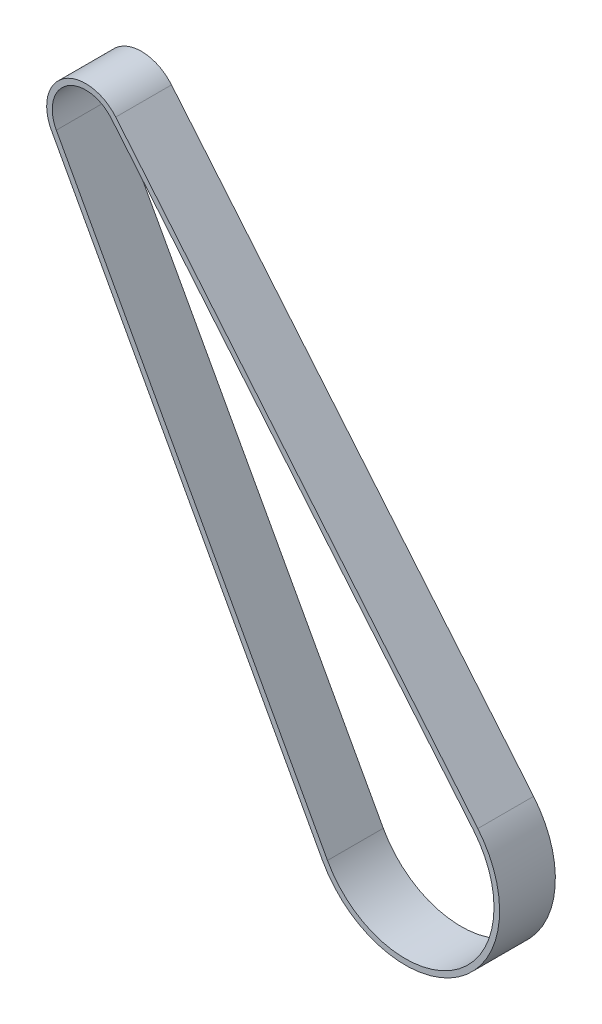
ISO-10303-21;
HEADER;
FILE_DESCRIPTION(('STEP AP214'),'2;1');
FILE_NAME('part.step','',(''),(''),'','','');
FILE_SCHEMA(('AUTOMOTIVE_DESIGN { 1 0 10303 214 1 1 1 1 }'));
ENDSEC;
DATA;
#1=APPLICATION_CONTEXT('core data for automotive mechanical design processes');
#2=APPLICATION_PROTOCOL_DEFINITION('international standard','automotive_design',2000,#1);
#3=PRODUCT_CONTEXT('',#1,'mechanical');
#4=PRODUCT('Part','Part','',(#3));
#5=PRODUCT_RELATED_PRODUCT_CATEGORY('part','',(#4));
#6=PRODUCT_DEFINITION_FORMATION('','',#4);
#7=PRODUCT_DEFINITION_CONTEXT('part definition',#1,'design');
#8=PRODUCT_DEFINITION('design','',#6,#7);
#9=PRODUCT_DEFINITION_SHAPE('','',#8);
#10=(LENGTH_UNIT() NAMED_UNIT(*) SI_UNIT(.MILLI.,.METRE.));
#11=(NAMED_UNIT(*) PLANE_ANGLE_UNIT() SI_UNIT($,.RADIAN.));
#12=(NAMED_UNIT(*) SI_UNIT($,.STERADIAN.) SOLID_ANGLE_UNIT());
#13=UNCERTAINTY_MEASURE_WITH_UNIT(LENGTH_MEASURE(1.E-05),#10,'distance_accuracy_value','');
#14=(GEOMETRIC_REPRESENTATION_CONTEXT(3) GLOBAL_UNCERTAINTY_ASSIGNED_CONTEXT((#13)) GLOBAL_UNIT_ASSIGNED_CONTEXT((#10,
#11,#12)) REPRESENTATION_CONTEXT('',''));
#15=CARTESIAN_POINT('',(0.,0.,0.));
#16=DIRECTION('',(0.,0.,1.));
#17=DIRECTION('',(1.,0.,0.));
#18=AXIS2_PLACEMENT_3D('',#15,#16,#17);
#19=CARTESIAN_POINT('',(0.,0.,10.));
#20=DIRECTION('',(0.,0.,1.));
#21=DIRECTION('',(1.,0.,0.));
#22=AXIS2_PLACEMENT_3D('',#19,#20,#21);
#23=PLANE('',#22);
#24=CARTESIAN_POINT('',(0.,0.,10.));
#25=DIRECTION('',(0.,0.,1.));
#26=DIRECTION('',(-1.,0.,0.));
#27=AXIS2_PLACEMENT_3D('',#24,#25,#26);
#28=CIRCLE('',#27,7.);
#29=CARTESIAN_POINT('',(5.38077329287627,4.47741876204018,10.));
#30=VERTEX_POINT('',#29);
#31=CARTESIAN_POINT('',(-6.14458476051221,-3.3532190684298,10.));
#32=VERTEX_POINT('',#31);
#33=EDGE_CURVE('E160',#30,#32,#28,.T.);
#34=ORIENTED_EDGE('',*,*,#33,.T.);
#35=DIRECTION('',(0.479031295489971,-0.877797822930315,0.));
#36=VECTOR('',#35,1.);
#37=CARTESIAN_POINT('',(42.4748656660749,-92.4456189561528,10.));
#38=LINE('',#37,#36);
#39=CARTESIAN_POINT('',(42.4748656660749,-92.4456189561528,10.));
#40=VERTEX_POINT('',#39);
#41=EDGE_CURVE('E163',#32,#40,#38,.T.);
#42=ORIENTED_EDGE('',*,*,#41,.T.);
#43=CARTESIAN_POINT('',(57.3096488735972,-84.3499900623723,10.));
#44=DIRECTION('',(0.,0.,1.));
#45=DIRECTION('',(-1.,0.,0.));
#46=AXIS2_PLACEMENT_3D('',#43,#44,#45);
#47=CIRCLE('',#46,16.9);
#48=CARTESIAN_POINT('',(70.3003729663985,-73.5402219083039,10.));
#49=VERTEX_POINT('',#48);
#50=EDGE_CURVE('E166',#40,#49,#47,.T.);
#51=ORIENTED_EDGE('',*,*,#50,.T.);
#52=DIRECTION('',(-0.639631251720026,0.768681898982325,0.));
#53=VECTOR('',#52,1.);
#54=CARTESIAN_POINT('',(5.38077329287627,4.47741876204018,10.));
#55=LINE('',#54,#53);
#56=EDGE_CURVE('E168',#49,#30,#55,.T.);
#57=ORIENTED_EDGE('',*,*,#56,.T.);
#58=EDGE_LOOP('',(#34,#42,#51,#57));
#59=FACE_BOUND('',#58,.T.);
#60=DIRECTION('',(0.479031295489971,-0.877797822930315,0.));
#61=VECTOR('',#60,1.);
#62=CARTESIAN_POINT('',(-5.26678693758189,-2.87418777293983,10.));
#63=LINE('',#62,#61);
#64=CARTESIAN_POINT('',(-5.26678693758189,-2.87418777293982,10.));
#65=VERTEX_POINT('',#64);
#66=CARTESIAN_POINT('',(43.3526634890052,-91.9665876606629,10.));
#67=VERTEX_POINT('',#66);
#68=EDGE_CURVE('E132',#65,#67,#63,.T.);
#69=ORIENTED_EDGE('',*,*,#68,.F.);
#70=CARTESIAN_POINT('',(0.,0.,10.));
#71=DIRECTION('',(0.,0.,-1.));
#72=DIRECTION('',(-1.,0.,0.));
#73=AXIS2_PLACEMENT_3D('',#70,#71,#72);
#74=CIRCLE('',#73,6.);
#75=CARTESIAN_POINT('',(4.61209139389395,3.83778751032016,10.));
#76=VERTEX_POINT('',#75);
#77=EDGE_CURVE('E124',#76,#65,#74,.F.);
#78=ORIENTED_EDGE('',*,*,#77,.F.);
#79=DIRECTION('',(-0.639631251720026,0.768681898982325,0.));
#80=VECTOR('',#79,1.);
#81=CARTESIAN_POINT('',(4.61209139389395,3.83778751032016,10.));
#82=LINE('',#81,#80);
#83=CARTESIAN_POINT('',(69.5316910674162,-74.1798531600239,10.));
#84=VERTEX_POINT('',#83);
#85=EDGE_CURVE('E146',#84,#76,#82,.T.);
#86=ORIENTED_EDGE('',*,*,#85,.F.);
#87=CARTESIAN_POINT('',(57.3096488735972,-84.3499900623723,10.));
#88=DIRECTION('',(0.,0.,-1.));
#89=DIRECTION('',(-1.,0.,0.));
#90=AXIS2_PLACEMENT_3D('',#87,#88,#89);
#91=CIRCLE('',#90,15.9);
#92=EDGE_CURVE('E144',#67,#84,#91,.F.);
#93=ORIENTED_EDGE('',*,*,#92,.F.);
#94=EDGE_LOOP('',(#69,#78,#86,#93));
#95=FACE_BOUND('',#94,.T.);
#96=ADVANCED_FACE('F59',(#59,#95),#23,.T.);
#97=CARTESIAN_POINT('',(0.,0.,0.));
#98=DIRECTION('',(0.,0.,1.));
#99=DIRECTION('',(1.,0.,0.));
#100=AXIS2_PLACEMENT_3D('',#97,#98,#99);
#101=PLANE('',#100);
#102=CARTESIAN_POINT('',(0.,0.,0.));
#103=DIRECTION('',(0.,0.,1.));
#104=DIRECTION('',(-1.,0.,0.));
#105=AXIS2_PLACEMENT_3D('',#102,#103,#104);
#106=CIRCLE('',#105,7.);
#107=CARTESIAN_POINT('',(5.38077329287627,4.47741876204018,0.));
#108=VERTEX_POINT('',#107);
#109=CARTESIAN_POINT('',(-6.14458476051221,-3.3532190684298,0.));
#110=VERTEX_POINT('',#109);
#111=EDGE_CURVE('E140',#108,#110,#106,.T.);
#112=ORIENTED_EDGE('',*,*,#111,.F.);
#113=DIRECTION('',(-0.639631251720026,0.768681898982325,0.));
#114=VECTOR('',#113,1.);
#115=CARTESIAN_POINT('',(5.38077329287627,4.47741876204018,0.));
#116=LINE('',#115,#114);
#117=CARTESIAN_POINT('',(70.3003729663985,-73.5402219083039,0.));
#118=VERTEX_POINT('',#117);
#119=EDGE_CURVE('E164',#118,#108,#116,.T.);
#120=ORIENTED_EDGE('',*,*,#119,.F.);
#121=CARTESIAN_POINT('',(57.3096488735972,-84.3499900623723,0.));
#122=DIRECTION('',(0.,0.,1.));
#123=DIRECTION('',(-1.,0.,0.));
#124=AXIS2_PLACEMENT_3D('',#121,#122,#123);
#125=CIRCLE('',#124,16.9);
#126=CARTESIAN_POINT('',(42.4748656660749,-92.4456189561528,0.));
#127=VERTEX_POINT('',#126);
#128=EDGE_CURVE('E175',#127,#118,#125,.T.);
#129=ORIENTED_EDGE('',*,*,#128,.F.);
#130=DIRECTION('',(0.479031295489971,-0.877797822930315,0.));
#131=VECTOR('',#130,1.);
#132=CARTESIAN_POINT('',(42.4748656660749,-92.4456189561528,0.));
#133=LINE('',#132,#131);
#134=EDGE_CURVE('E173',#110,#127,#133,.T.);
#135=ORIENTED_EDGE('',*,*,#134,.F.);
#136=EDGE_LOOP('',(#112,#120,#129,#135));
#137=FACE_BOUND('',#136,.T.);
#138=CARTESIAN_POINT('',(0.,0.,0.));
#139=DIRECTION('',(0.,0.,-1.));
#140=DIRECTION('',(-1.,0.,0.));
#141=AXIS2_PLACEMENT_3D('',#138,#139,#140);
#142=CIRCLE('',#141,6.);
#143=CARTESIAN_POINT('',(4.61209139389395,3.83778751032016,0.));
#144=VERTEX_POINT('',#143);
#145=CARTESIAN_POINT('',(-5.26678693758189,-2.87418777293982,0.));
#146=VERTEX_POINT('',#145);
#147=EDGE_CURVE('E82',#144,#146,#142,.F.);
#148=ORIENTED_EDGE('',*,*,#147,.T.);
#149=DIRECTION('',(0.479031295489971,-0.877797822930315,0.));
#150=VECTOR('',#149,1.);
#151=CARTESIAN_POINT('',(-5.26678693758189,-2.87418777293983,0.));
#152=LINE('',#151,#150);
#153=CARTESIAN_POINT('',(43.3526634890052,-91.9665876606629,0.));
#154=VERTEX_POINT('',#153);
#155=EDGE_CURVE('E139',#146,#154,#152,.T.);
#156=ORIENTED_EDGE('',*,*,#155,.T.);
#157=CARTESIAN_POINT('',(57.3096488735972,-84.3499900623723,0.));
#158=DIRECTION('',(0.,0.,-1.));
#159=DIRECTION('',(-1.,0.,0.));
#160=AXIS2_PLACEMENT_3D('',#157,#158,#159);
#161=CIRCLE('',#160,15.9);
#162=CARTESIAN_POINT('',(69.5316910674162,-74.1798531600239,0.));
#163=VERTEX_POINT('',#162);
#164=EDGE_CURVE('E152',#154,#163,#161,.F.);
#165=ORIENTED_EDGE('',*,*,#164,.T.);
#166=DIRECTION('',(-0.639631251720026,0.768681898982325,0.));
#167=VECTOR('',#166,1.);
#168=CARTESIAN_POINT('',(4.61209139389395,3.83778751032016,0.));
#169=LINE('',#168,#167);
#170=EDGE_CURVE('E133',#163,#144,#169,.T.);
#171=ORIENTED_EDGE('',*,*,#170,.T.);
#172=EDGE_LOOP('',(#148,#156,#165,#171));
#173=FACE_BOUND('',#172,.T.);
#174=ADVANCED_FACE('F193',(#137,#173),#101,.F.);
#175=CARTESIAN_POINT('',(0.,0.,10.));
#176=DIRECTION('',(0.,0.,-1.));
#177=DIRECTION('',(-1.,0.,0.));
#178=AXIS2_PLACEMENT_3D('',#175,#176,#177);
#179=CYLINDRICAL_SURFACE('',#178,7.);
#180=ORIENTED_EDGE('',*,*,#111,.T.);
#181=DIRECTION('',(0.,0.,-1.));
#182=VECTOR('',#181,1.);
#183=CARTESIAN_POINT('',(-6.14458476051221,-3.3532190684298,10.));
#184=LINE('',#183,#182);
#185=EDGE_CURVE('E12',#32,#110,#184,.T.);
#186=ORIENTED_EDGE('',*,*,#185,.F.);
#187=ORIENTED_EDGE('',*,*,#33,.F.);
#188=DIRECTION('',(0.,0.,-1.));
#189=VECTOR('',#188,1.);
#190=CARTESIAN_POINT('',(5.38077329287627,4.47741876204018,10.));
#191=LINE('',#190,#189);
#192=EDGE_CURVE('E170',#30,#108,#191,.T.);
#193=ORIENTED_EDGE('',*,*,#192,.T.);
#194=EDGE_LOOP('',(#180,#186,#187,#193));
#195=FACE_BOUND('',#194,.T.);
#196=ADVANCED_FACE('F61',(#195),#179,.T.);
#197=CARTESIAN_POINT('',(42.4748656660749,-92.4456189561528,10.));
#198=DIRECTION('',(0.877797822930315,0.479031295489971,0.));
#199=DIRECTION('',(-0.479031295489971,0.877797822930315,0.));
#200=AXIS2_PLACEMENT_3D('',#197,#198,#199);
#201=PLANE('',#200);
#202=ORIENTED_EDGE('',*,*,#134,.T.);
#203=DIRECTION('',(0.,0.,-1.));
#204=VECTOR('',#203,1.);
#205=CARTESIAN_POINT('',(42.4748656660749,-92.4456189561528,10.));
#206=LINE('',#205,#204);
#207=EDGE_CURVE('E67',#40,#127,#206,.T.);
#208=ORIENTED_EDGE('',*,*,#207,.F.);
#209=ORIENTED_EDGE('',*,*,#41,.F.);
#210=ORIENTED_EDGE('',*,*,#185,.T.);
#211=EDGE_LOOP('',(#202,#208,#209,#210));
#212=FACE_BOUND('',#211,.T.);
#213=ADVANCED_FACE('F203',(#212),#201,.F.);
#214=CARTESIAN_POINT('',(57.3096488735972,-84.3499900623723,10.));
#215=DIRECTION('',(0.,0.,-1.));
#216=DIRECTION('',(-1.,0.,0.));
#217=AXIS2_PLACEMENT_3D('',#214,#215,#216);
#218=CYLINDRICAL_SURFACE('',#217,16.9);
#219=ORIENTED_EDGE('',*,*,#128,.T.);
#220=DIRECTION('',(0.,0.,-1.));
#221=VECTOR('',#220,1.);
#222=CARTESIAN_POINT('',(70.3003729663985,-73.5402219083039,10.));
#223=LINE('',#222,#221);
#224=EDGE_CURVE('E180',#49,#118,#223,.T.);
#225=ORIENTED_EDGE('',*,*,#224,.F.);
#226=ORIENTED_EDGE('',*,*,#50,.F.);
#227=ORIENTED_EDGE('',*,*,#207,.T.);
#228=EDGE_LOOP('',(#219,#225,#226,#227));
#229=FACE_BOUND('',#228,.T.);
#230=ADVANCED_FACE('F187',(#229),#218,.T.);
#231=CARTESIAN_POINT('',(5.38077329287627,4.47741876204018,10.));
#232=DIRECTION('',(-0.768681898982325,-0.639631251720026,0.));
#233=DIRECTION('',(0.639631251720026,-0.768681898982325,0.));
#234=AXIS2_PLACEMENT_3D('',#231,#232,#233);
#235=PLANE('',#234);
#236=ORIENTED_EDGE('',*,*,#119,.T.);
#237=ORIENTED_EDGE('',*,*,#192,.F.);
#238=ORIENTED_EDGE('',*,*,#56,.F.);
#239=ORIENTED_EDGE('',*,*,#224,.T.);
#240=EDGE_LOOP('',(#236,#237,#238,#239));
#241=FACE_BOUND('',#240,.T.);
#242=ADVANCED_FACE('F197',(#241),#235,.F.);
#243=CARTESIAN_POINT('',(0.,0.,10.));
#244=DIRECTION('',(0.,0.,-1.));
#245=DIRECTION('',(-1.,0.,0.));
#246=AXIS2_PLACEMENT_3D('',#243,#244,#245);
#247=CYLINDRICAL_SURFACE('',#246,6.);
#248=ORIENTED_EDGE('',*,*,#147,.F.);
#249=DIRECTION('',(0.,0.,-1.));
#250=VECTOR('',#249,1.);
#251=CARTESIAN_POINT('',(4.61209139389395,3.83778751032016,10.));
#252=LINE('',#251,#250);
#253=EDGE_CURVE('E128',#76,#144,#252,.T.);
#254=ORIENTED_EDGE('',*,*,#253,.F.);
#255=ORIENTED_EDGE('',*,*,#77,.T.);
#256=DIRECTION('',(0.,0.,-1.));
#257=VECTOR('',#256,1.);
#258=CARTESIAN_POINT('',(-5.26678693758189,-2.87418777293982,10.));
#259=LINE('',#258,#257);
#260=EDGE_CURVE('E127',#65,#146,#259,.T.);
#261=ORIENTED_EDGE('',*,*,#260,.T.);
#262=EDGE_LOOP('',(#248,#254,#255,#261));
#263=FACE_BOUND('',#262,.T.);
#264=ADVANCED_FACE('F126',(#263),#247,.F.);
#265=CARTESIAN_POINT('',(-5.26678693758189,-2.87418777293983,10.));
#266=DIRECTION('',(0.877797822930315,0.479031295489971,0.));
#267=DIRECTION('',(-0.479031295489971,0.877797822930315,0.));
#268=AXIS2_PLACEMENT_3D('',#265,#266,#267);
#269=PLANE('',#268);
#270=ORIENTED_EDGE('',*,*,#155,.F.);
#271=ORIENTED_EDGE('',*,*,#260,.F.);
#272=ORIENTED_EDGE('',*,*,#68,.T.);
#273=DIRECTION('',(0.,0.,-1.));
#274=VECTOR('',#273,1.);
#275=CARTESIAN_POINT('',(43.3526634890052,-91.9665876606629,10.));
#276=LINE('',#275,#274);
#277=EDGE_CURVE('E141',#67,#154,#276,.T.);
#278=ORIENTED_EDGE('',*,*,#277,.T.);
#279=EDGE_LOOP('',(#270,#271,#272,#278));
#280=FACE_BOUND('',#279,.T.);
#281=ADVANCED_FACE('F136',(#280),#269,.T.);
#282=CARTESIAN_POINT('',(57.3096488735972,-84.3499900623723,10.));
#283=DIRECTION('',(0.,0.,-1.));
#284=DIRECTION('',(-1.,0.,0.));
#285=AXIS2_PLACEMENT_3D('',#282,#283,#284);
#286=CYLINDRICAL_SURFACE('',#285,15.9);
#287=ORIENTED_EDGE('',*,*,#164,.F.);
#288=ORIENTED_EDGE('',*,*,#277,.F.);
#289=ORIENTED_EDGE('',*,*,#92,.T.);
#290=DIRECTION('',(0.,0.,-1.));
#291=VECTOR('',#290,1.);
#292=CARTESIAN_POINT('',(69.5316910674162,-74.1798531600239,10.));
#293=LINE('',#292,#291);
#294=EDGE_CURVE('E74',#84,#163,#293,.T.);
#295=ORIENTED_EDGE('',*,*,#294,.T.);
#296=EDGE_LOOP('',(#287,#288,#289,#295));
#297=FACE_BOUND('',#296,.T.);
#298=ADVANCED_FACE('F226',(#297),#286,.F.);
#299=CARTESIAN_POINT('',(4.61209139389395,3.83778751032016,10.));
#300=DIRECTION('',(-0.768681898982325,-0.639631251720026,0.));
#301=DIRECTION('',(0.639631251720026,-0.768681898982325,0.));
#302=AXIS2_PLACEMENT_3D('',#299,#300,#301);
#303=PLANE('',#302);
#304=ORIENTED_EDGE('',*,*,#170,.F.);
#305=ORIENTED_EDGE('',*,*,#294,.F.);
#306=ORIENTED_EDGE('',*,*,#85,.T.);
#307=ORIENTED_EDGE('',*,*,#253,.T.);
#308=EDGE_LOOP('',(#304,#305,#306,#307));
#309=FACE_BOUND('',#308,.T.);
#310=ADVANCED_FACE('F230',(#309),#303,.T.);
#311=CLOSED_SHELL('',(#96,#174,#196,#213,#230,#242,#264,#281,#298,#310));
#312=MANIFOLD_SOLID_BREP('B2',#311);
#313=ADVANCED_BREP_SHAPE_REPRESENTATION('',(#18,#312),#14);
#314=SHAPE_DEFINITION_REPRESENTATION(#9,#313);
ENDSEC;
END-ISO-10303-21;
